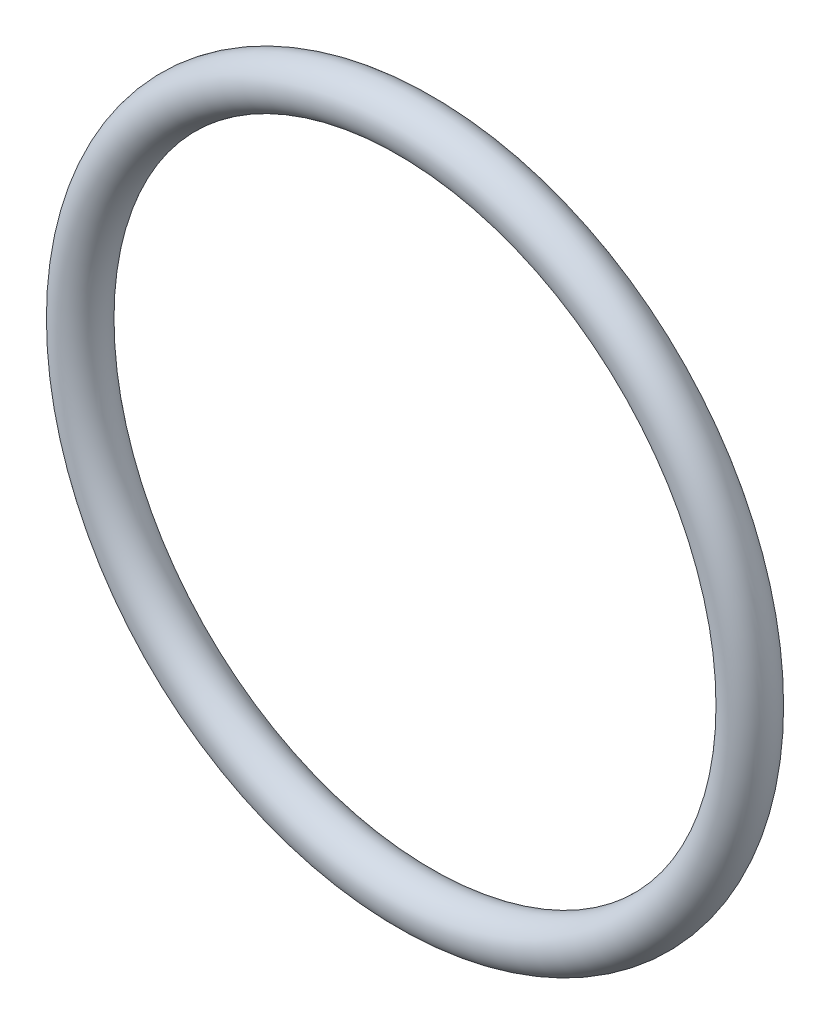
ISO-10303-21;
HEADER;
FILE_DESCRIPTION(('STEP AP214'),'2;1');
FILE_NAME('part.step','',(''),(''),'','','');
FILE_SCHEMA(('AUTOMOTIVE_DESIGN { 1 0 10303 214 1 1 1 1 }'));
ENDSEC;
DATA;
#1=APPLICATION_CONTEXT('core data for automotive mechanical design processes');
#2=APPLICATION_PROTOCOL_DEFINITION('international standard','automotive_design',2000,#1);
#3=PRODUCT_CONTEXT('',#1,'mechanical');
#4=PRODUCT('Part','Part','',(#3));
#5=PRODUCT_RELATED_PRODUCT_CATEGORY('part','',(#4));
#6=PRODUCT_DEFINITION_FORMATION('','',#4);
#7=PRODUCT_DEFINITION_CONTEXT('part definition',#1,'design');
#8=PRODUCT_DEFINITION('design','',#6,#7);
#9=PRODUCT_DEFINITION_SHAPE('','',#8);
#10=(LENGTH_UNIT() NAMED_UNIT(*) SI_UNIT(.MILLI.,.METRE.));
#11=(NAMED_UNIT(*) PLANE_ANGLE_UNIT() SI_UNIT($,.RADIAN.));
#12=(NAMED_UNIT(*) SI_UNIT($,.STERADIAN.) SOLID_ANGLE_UNIT());
#13=UNCERTAINTY_MEASURE_WITH_UNIT(LENGTH_MEASURE(1.E-05),#10,'distance_accuracy_value','');
#14=(GEOMETRIC_REPRESENTATION_CONTEXT(3) GLOBAL_UNCERTAINTY_ASSIGNED_CONTEXT((#13)) GLOBAL_UNIT_ASSIGNED_CONTEXT((#10,
#11,#12)) REPRESENTATION_CONTEXT('',''));
#15=CARTESIAN_POINT('',(0.,0.,0.));
#16=DIRECTION('',(0.,0.,1.));
#17=DIRECTION('',(1.,0.,0.));
#18=AXIS2_PLACEMENT_3D('',#15,#16,#17);
#19=CARTESIAN_POINT('',(0.,0.,0.));
#20=DIRECTION('',(0.,0.,1.));
#21=DIRECTION('',(1.,0.,0.));
#22=AXIS2_PLACEMENT_3D('',#19,#20,#21);
#23=TOROIDAL_SURFACE('',#22,7.,0.500000000000001);
#24=CARTESIAN_POINT('',(7.5,0.,0.));
#25=VERTEX_POINT('',#24);
#26=VERTEX_LOOP('',#25);
#27=FACE_BOUND('',#26,.T.);
#28=ADVANCED_FACE('F33',(#27),#23,.T.);
#29=CLOSED_SHELL('',(#28));
#30=MANIFOLD_SOLID_BREP('B2',#29);
#31=ADVANCED_BREP_SHAPE_REPRESENTATION('',(#18,#30),#14);
#32=SHAPE_DEFINITION_REPRESENTATION(#9,#31);
ENDSEC;
END-ISO-10303-21;
